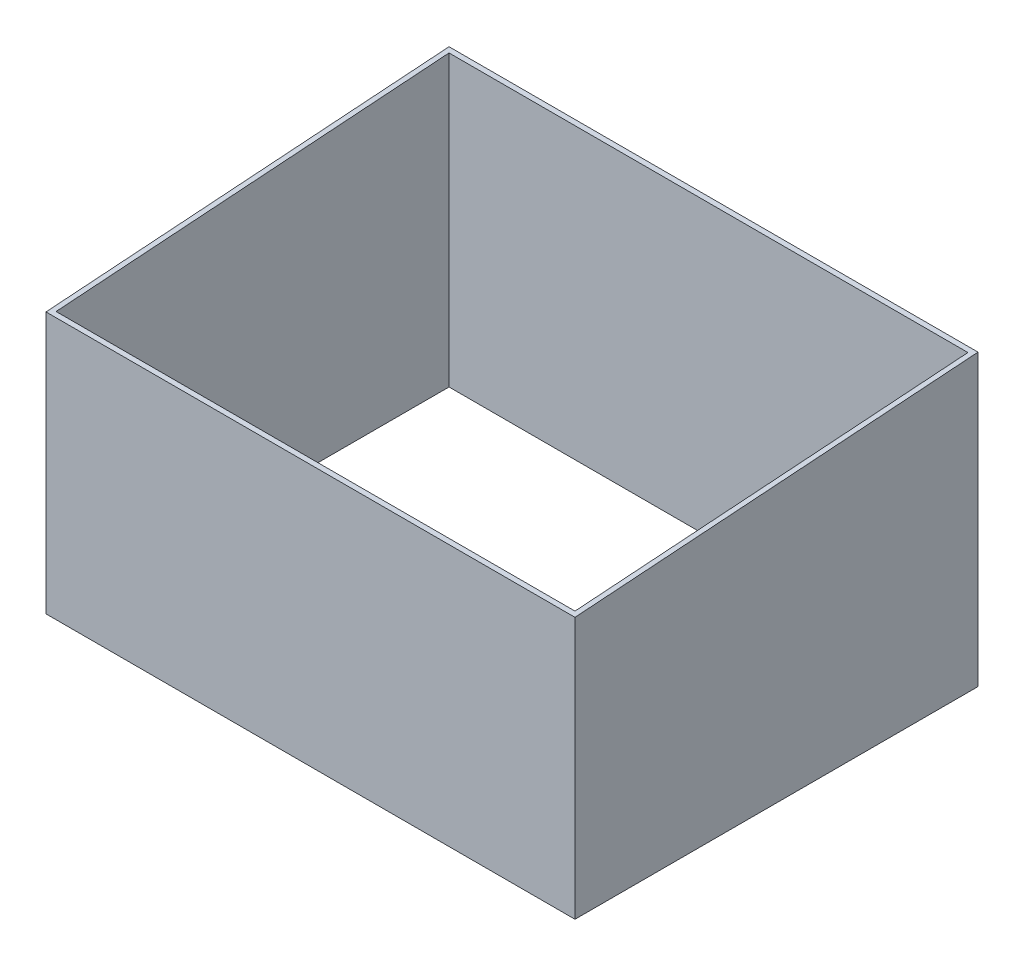
ISO-10303-21;
HEADER;
FILE_DESCRIPTION(('STEP AP214'),'2;1');
FILE_NAME('part.step','',(''),(''),'','','');
FILE_SCHEMA(('AUTOMOTIVE_DESIGN { 1 0 10303 214 1 1 1 1 }'));
ENDSEC;
DATA;
#1=APPLICATION_CONTEXT('core data for automotive mechanical design processes');
#2=APPLICATION_PROTOCOL_DEFINITION('international standard','automotive_design',2000,#1);
#3=PRODUCT_CONTEXT('',#1,'mechanical');
#4=PRODUCT('Part','Part','',(#3));
#5=PRODUCT_RELATED_PRODUCT_CATEGORY('part','',(#4));
#6=PRODUCT_DEFINITION_FORMATION('','',#4);
#7=PRODUCT_DEFINITION_CONTEXT('part definition',#1,'design');
#8=PRODUCT_DEFINITION('design','',#6,#7);
#9=PRODUCT_DEFINITION_SHAPE('','',#8);
#10=(LENGTH_UNIT() NAMED_UNIT(*) SI_UNIT(.MILLI.,.METRE.));
#11=(NAMED_UNIT(*) PLANE_ANGLE_UNIT() SI_UNIT($,.RADIAN.));
#12=(NAMED_UNIT(*) SI_UNIT($,.STERADIAN.) SOLID_ANGLE_UNIT());
#13=UNCERTAINTY_MEASURE_WITH_UNIT(LENGTH_MEASURE(1.E-05),#10,'distance_accuracy_value','');
#14=(GEOMETRIC_REPRESENTATION_CONTEXT(3) GLOBAL_UNCERTAINTY_ASSIGNED_CONTEXT((#13)) GLOBAL_UNIT_ASSIGNED_CONTEXT((#10,
#11,#12)) REPRESENTATION_CONTEXT('',''));
#15=CARTESIAN_POINT('',(0.,0.,0.));
#16=DIRECTION('',(0.,0.,1.));
#17=DIRECTION('',(1.,0.,0.));
#18=AXIS2_PLACEMENT_3D('',#15,#16,#17);
#19=CARTESIAN_POINT('',(0.,2300.,0.));
#20=DIRECTION('',(1.,0.,0.));
#21=DIRECTION('',(0.,0.,-1.));
#22=AXIS2_PLACEMENT_3D('',#19,#20,#21);
#23=PLANE('',#22);
#24=DIRECTION('',(0.,0.0696905112577319,-0.997568660614715));
#25=VECTOR('',#24,1.);
#26=CARTESIAN_POINT('',(0.,2300.,-3200.));
#27=LINE('',#26,#25);
#28=CARTESIAN_POINT('',(0.,2076.44683034918,0.));
#29=VERTEX_POINT('',#28);
#30=CARTESIAN_POINT('',(0.,2300.,-3200.));
#31=VERTEX_POINT('',#30);
#32=EDGE_CURVE('E130',#29,#31,#27,.T.);
#33=ORIENTED_EDGE('',*,*,#32,.T.);
#34=DIRECTION('',(0.,-1.,0.));
#35=VECTOR('',#34,1.);
#36=CARTESIAN_POINT('',(0.,2300.,-3200.));
#37=LINE('',#36,#35);
#38=CARTESIAN_POINT('',(0.,0.,-3200.));
#39=VERTEX_POINT('',#38);
#40=EDGE_CURVE('E149',#31,#39,#37,.T.);
#41=ORIENTED_EDGE('',*,*,#40,.T.);
#42=DIRECTION('',(0.,0.,1.));
#43=VECTOR('',#42,1.);
#44=CARTESIAN_POINT('',(0.,0.,0.));
#45=LINE('',#44,#43);
#46=CARTESIAN_POINT('',(0.,0.,0.));
#47=VERTEX_POINT('',#46);
#48=EDGE_CURVE('E160',#39,#47,#45,.T.);
#49=ORIENTED_EDGE('',*,*,#48,.T.);
#50=DIRECTION('',(0.,-1.,0.));
#51=VECTOR('',#50,1.);
#52=CARTESIAN_POINT('',(0.,2300.,0.));
#53=LINE('',#52,#51);
#54=EDGE_CURVE('E68',#29,#47,#53,.T.);
#55=ORIENTED_EDGE('',*,*,#54,.F.);
#56=EDGE_LOOP('',(#33,#41,#49,#55));
#57=FACE_BOUND('',#56,.T.);
#58=ADVANCED_FACE('F61',(#57),#23,.F.);
#59=CARTESIAN_POINT('',(0.,2300.,0.));
#60=DIRECTION('',(0.,0.,-1.));
#61=DIRECTION('',(-1.,0.,0.));
#62=AXIS2_PLACEMENT_3D('',#59,#60,#61);
#63=PLANE('',#62);
#64=DIRECTION('',(-1.,0.,0.));
#65=VECTOR('',#64,1.);
#66=CARTESIAN_POINT('',(4200.,2076.44683034918,0.));
#67=LINE('',#66,#65);
#68=CARTESIAN_POINT('',(4200.,2076.44683034918,0.));
#69=VERTEX_POINT('',#68);
#70=EDGE_CURVE('E124',#69,#29,#67,.T.);
#71=ORIENTED_EDGE('',*,*,#70,.T.);
#72=ORIENTED_EDGE('',*,*,#54,.T.);
#73=DIRECTION('',(1.,0.,0.));
#74=VECTOR('',#73,1.);
#75=CARTESIAN_POINT('',(0.,0.,0.));
#76=LINE('',#75,#74);
#77=CARTESIAN_POINT('',(4200.,0.,0.));
#78=VERTEX_POINT('',#77);
#79=EDGE_CURVE('E146',#47,#78,#76,.T.);
#80=ORIENTED_EDGE('',*,*,#79,.T.);
#81=DIRECTION('',(0.,-1.,0.));
#82=VECTOR('',#81,1.);
#83=CARTESIAN_POINT('',(4200.,2300.,0.));
#84=LINE('',#83,#82);
#85=EDGE_CURVE('E138',#69,#78,#84,.T.);
#86=ORIENTED_EDGE('',*,*,#85,.F.);
#87=EDGE_LOOP('',(#71,#72,#80,#86));
#88=FACE_BOUND('',#87,.T.);
#89=ADVANCED_FACE('F144',(#88),#63,.F.);
#90=CARTESIAN_POINT('',(4200.,2300.,0.));
#91=DIRECTION('',(-1.,0.,0.));
#92=DIRECTION('',(0.,0.,1.));
#93=AXIS2_PLACEMENT_3D('',#90,#91,#92);
#94=PLANE('',#93);
#95=DIRECTION('',(0.,0.0696905112577319,-0.997568660614715));
#96=VECTOR('',#95,1.);
#97=CARTESIAN_POINT('',(4200.,2300.,-3200.));
#98=LINE('',#97,#96);
#99=CARTESIAN_POINT('',(4200.,2300.,-3200.));
#100=VERTEX_POINT('',#99);
#101=EDGE_CURVE('E127',#69,#100,#98,.T.);
#102=ORIENTED_EDGE('',*,*,#101,.F.);
#103=ORIENTED_EDGE('',*,*,#85,.T.);
#104=DIRECTION('',(0.,0.,-1.));
#105=VECTOR('',#104,1.);
#106=CARTESIAN_POINT('',(4200.,0.,0.));
#107=LINE('',#106,#105);
#108=CARTESIAN_POINT('',(4200.,0.,-3200.));
#109=VERTEX_POINT('',#108);
#110=EDGE_CURVE('E157',#78,#109,#107,.T.);
#111=ORIENTED_EDGE('',*,*,#110,.T.);
#112=DIRECTION('',(0.,-1.,0.));
#113=VECTOR('',#112,1.);
#114=CARTESIAN_POINT('',(4200.,2300.,-3200.));
#115=LINE('',#114,#113);
#116=EDGE_CURVE('E141',#100,#109,#115,.T.);
#117=ORIENTED_EDGE('',*,*,#116,.F.);
#118=EDGE_LOOP('',(#102,#103,#111,#117));
#119=FACE_BOUND('',#118,.T.);
#120=ADVANCED_FACE('F137',(#119),#94,.F.);
#121=CARTESIAN_POINT('',(40.,2300.,0.));
#122=DIRECTION('',(1.,0.,0.));
#123=DIRECTION('',(0.,0.,-1.));
#124=AXIS2_PLACEMENT_3D('',#121,#122,#123);
#125=PLANE('',#124);
#126=DIRECTION('',(0.,-1.,0.));
#127=VECTOR('',#126,1.);
#128=CARTESIAN_POINT('',(40.,2300.,-3160.));
#129=LINE('',#128,#127);
#130=CARTESIAN_POINT('',(40.,2297.20558537936,-3160.));
#131=VERTEX_POINT('',#130);
#132=CARTESIAN_POINT('',(40.,0.,-3160.));
#133=VERTEX_POINT('',#132);
#134=EDGE_CURVE('E81',#131,#133,#129,.T.);
#135=ORIENTED_EDGE('',*,*,#134,.F.);
#136=DIRECTION('',(0.,-0.0696905112577319,0.997568660614715));
#137=VECTOR('',#136,1.);
#138=CARTESIAN_POINT('',(40.,2077.53257608662,-15.541655549965));
#139=LINE('',#138,#137);
#140=CARTESIAN_POINT('',(40.,2079.24124496982,-40.));
#141=VERTEX_POINT('',#140);
#142=EDGE_CURVE('E75',#131,#141,#139,.T.);
#143=ORIENTED_EDGE('',*,*,#142,.T.);
#144=DIRECTION('',(0.,-1.,0.));
#145=VECTOR('',#144,1.);
#146=CARTESIAN_POINT('',(40.,2300.,-40.));
#147=LINE('',#146,#145);
#148=CARTESIAN_POINT('',(40.,0.,-40.));
#149=VERTEX_POINT('',#148);
#150=EDGE_CURVE('E163',#141,#149,#147,.T.);
#151=ORIENTED_EDGE('',*,*,#150,.T.);
#152=DIRECTION('',(0.,0.,1.));
#153=VECTOR('',#152,1.);
#154=CARTESIAN_POINT('',(40.,0.,0.));
#155=LINE('',#154,#153);
#156=EDGE_CURVE('E180',#133,#149,#155,.T.);
#157=ORIENTED_EDGE('',*,*,#156,.F.);
#158=EDGE_LOOP('',(#135,#143,#151,#157));
#159=FACE_BOUND('',#158,.T.);
#160=ADVANCED_FACE('F203',(#159),#125,.T.);
#161=CARTESIAN_POINT('',(0.,2300.,-40.));
#162=DIRECTION('',(0.,0.,-1.));
#163=DIRECTION('',(-1.,0.,0.));
#164=AXIS2_PLACEMENT_3D('',#161,#162,#163);
#165=PLANE('',#164);
#166=ORIENTED_EDGE('',*,*,#150,.F.);
#167=DIRECTION('',(1.,0.,0.));
#168=VECTOR('',#167,1.);
#169=CARTESIAN_POINT('',(0.,2079.24124496982,-40.));
#170=LINE('',#169,#168);
#171=CARTESIAN_POINT('',(4160.,2079.24124496982,-40.));
#172=VERTEX_POINT('',#171);
#173=EDGE_CURVE('E184',#141,#172,#170,.T.);
#174=ORIENTED_EDGE('',*,*,#173,.T.);
#175=DIRECTION('',(0.,-1.,0.));
#176=VECTOR('',#175,1.);
#177=CARTESIAN_POINT('',(4160.,2300.,-40.));
#178=LINE('',#177,#176);
#179=CARTESIAN_POINT('',(4160.,0.,-40.));
#180=VERTEX_POINT('',#179);
#181=EDGE_CURVE('E166',#172,#180,#178,.T.);
#182=ORIENTED_EDGE('',*,*,#181,.T.);
#183=DIRECTION('',(1.,0.,0.));
#184=VECTOR('',#183,1.);
#185=CARTESIAN_POINT('',(0.,0.,-40.));
#186=LINE('',#185,#184);
#187=EDGE_CURVE('E177',#149,#180,#186,.T.);
#188=ORIENTED_EDGE('',*,*,#187,.F.);
#189=EDGE_LOOP('',(#166,#174,#182,#188));
#190=FACE_BOUND('',#189,.T.);
#191=ADVANCED_FACE('F206',(#190),#165,.T.);
#192=CARTESIAN_POINT('',(4160.,2300.,0.));
#193=DIRECTION('',(-1.,0.,0.));
#194=DIRECTION('',(0.,0.,1.));
#195=AXIS2_PLACEMENT_3D('',#192,#193,#194);
#196=PLANE('',#195);
#197=ORIENTED_EDGE('',*,*,#181,.F.);
#198=DIRECTION('',(0.,0.0696905112577319,-0.997568660614715));
#199=VECTOR('',#198,1.);
#200=CARTESIAN_POINT('',(4160.,2077.53257608662,-15.541655549965));
#201=LINE('',#200,#199);
#202=CARTESIAN_POINT('',(4160.,2297.20558537936,-3160.));
#203=VERTEX_POINT('',#202);
#204=EDGE_CURVE('E134',#172,#203,#201,.T.);
#205=ORIENTED_EDGE('',*,*,#204,.T.);
#206=DIRECTION('',(0.,-1.,0.));
#207=VECTOR('',#206,1.);
#208=CARTESIAN_POINT('',(4160.,2300.,-3160.));
#209=LINE('',#208,#207);
#210=CARTESIAN_POINT('',(4160.,0.,-3160.));
#211=VERTEX_POINT('',#210);
#212=EDGE_CURVE('E168',#203,#211,#209,.T.);
#213=ORIENTED_EDGE('',*,*,#212,.T.);
#214=DIRECTION('',(0.,0.,-1.));
#215=VECTOR('',#214,1.);
#216=CARTESIAN_POINT('',(4160.,0.,0.));
#217=LINE('',#216,#215);
#218=EDGE_CURVE('E174',#180,#211,#217,.T.);
#219=ORIENTED_EDGE('',*,*,#218,.F.);
#220=EDGE_LOOP('',(#197,#205,#213,#219));
#221=FACE_BOUND('',#220,.T.);
#222=ADVANCED_FACE('F210',(#221),#196,.T.);
#223=CARTESIAN_POINT('',(0.,2300.,-3160.));
#224=DIRECTION('',(0.,0.,1.));
#225=DIRECTION('',(1.,0.,0.));
#226=AXIS2_PLACEMENT_3D('',#223,#224,#225);
#227=PLANE('',#226);
#228=ORIENTED_EDGE('',*,*,#212,.F.);
#229=DIRECTION('',(-1.,0.,0.));
#230=VECTOR('',#229,1.);
#231=CARTESIAN_POINT('',(0.,2297.20558537936,-3160.));
#232=LINE('',#231,#230);
#233=EDGE_CURVE('E13',#203,#131,#232,.T.);
#234=ORIENTED_EDGE('',*,*,#233,.T.);
#235=ORIENTED_EDGE('',*,*,#134,.T.);
#236=DIRECTION('',(-1.,0.,0.));
#237=VECTOR('',#236,1.);
#238=CARTESIAN_POINT('',(0.,0.,-3160.));
#239=LINE('',#238,#237);
#240=EDGE_CURVE('E171',#211,#133,#239,.T.);
#241=ORIENTED_EDGE('',*,*,#240,.F.);
#242=EDGE_LOOP('',(#228,#234,#235,#241));
#243=FACE_BOUND('',#242,.T.);
#244=ADVANCED_FACE('F199',(#243),#227,.T.);
#245=CARTESIAN_POINT('',(0.,0.,0.));
#246=DIRECTION('',(0.,1.,0.));
#247=DIRECTION('',(0.,0.,1.));
#248=AXIS2_PLACEMENT_3D('',#245,#246,#247);
#249=PLANE('',#248);
#250=ORIENTED_EDGE('',*,*,#48,.F.);
#251=DIRECTION('',(-1.,0.,0.));
#252=VECTOR('',#251,1.);
#253=CARTESIAN_POINT('',(0.,0.,-3200.));
#254=LINE('',#253,#252);
#255=EDGE_CURVE('E155',#109,#39,#254,.T.);
#256=ORIENTED_EDGE('',*,*,#255,.F.);
#257=ORIENTED_EDGE('',*,*,#110,.F.);
#258=ORIENTED_EDGE('',*,*,#79,.F.);
#259=EDGE_LOOP('',(#250,#256,#257,#258));
#260=FACE_BOUND('',#259,.T.);
#261=ORIENTED_EDGE('',*,*,#156,.T.);
#262=ORIENTED_EDGE('',*,*,#187,.T.);
#263=ORIENTED_EDGE('',*,*,#218,.T.);
#264=ORIENTED_EDGE('',*,*,#240,.T.);
#265=EDGE_LOOP('',(#261,#262,#263,#264));
#266=FACE_BOUND('',#265,.T.);
#267=ADVANCED_FACE('F196',(#260,#266),#249,.F.);
#268=CARTESIAN_POINT('',(0.,2300.,-3200.));
#269=DIRECTION('',(0.,0.,1.));
#270=DIRECTION('',(1.,0.,0.));
#271=AXIS2_PLACEMENT_3D('',#268,#269,#270);
#272=PLANE('',#271);
#273=ORIENTED_EDGE('',*,*,#255,.T.);
#274=ORIENTED_EDGE('',*,*,#40,.F.);
#275=DIRECTION('',(-1.,0.,0.));
#276=VECTOR('',#275,1.);
#277=CARTESIAN_POINT('',(0.,2300.,-3200.));
#278=LINE('',#277,#276);
#279=EDGE_CURVE('E154',#100,#31,#278,.T.);
#280=ORIENTED_EDGE('',*,*,#279,.F.);
#281=ORIENTED_EDGE('',*,*,#116,.T.);
#282=EDGE_LOOP('',(#273,#274,#280,#281));
#283=FACE_BOUND('',#282,.T.);
#284=ADVANCED_FACE('F193',(#283),#272,.F.);
#285=CARTESIAN_POINT('',(4200.,2300.,-3200.));
#286=DIRECTION('',(0.,0.997568660614715,0.0696905112577319));
#287=DIRECTION('',(0.,-0.0696905112577319,0.997568660614715));
#288=AXIS2_PLACEMENT_3D('',#285,#286,#287);
#289=PLANE('',#288);
#290=ORIENTED_EDGE('',*,*,#233,.F.);
#291=ORIENTED_EDGE('',*,*,#204,.F.);
#292=ORIENTED_EDGE('',*,*,#173,.F.);
#293=ORIENTED_EDGE('',*,*,#142,.F.);
#294=EDGE_LOOP('',(#290,#291,#292,#293));
#295=FACE_BOUND('',#294,.T.);
#296=ORIENTED_EDGE('',*,*,#32,.F.);
#297=ORIENTED_EDGE('',*,*,#70,.F.);
#298=ORIENTED_EDGE('',*,*,#101,.T.);
#299=ORIENTED_EDGE('',*,*,#279,.T.);
#300=EDGE_LOOP('',(#296,#297,#298,#299));
#301=FACE_BOUND('',#300,.T.);
#302=ADVANCED_FACE('F126',(#295,#301),#289,.T.);
#303=CLOSED_SHELL('',(#58,#89,#120,#160,#191,#222,#244,#267,#284,#302));
#304=MANIFOLD_SOLID_BREP('B2',#303);
#305=ADVANCED_BREP_SHAPE_REPRESENTATION('',(#18,#304),#14);
#306=SHAPE_DEFINITION_REPRESENTATION(#9,#305);
ENDSEC;
END-ISO-10303-21;
